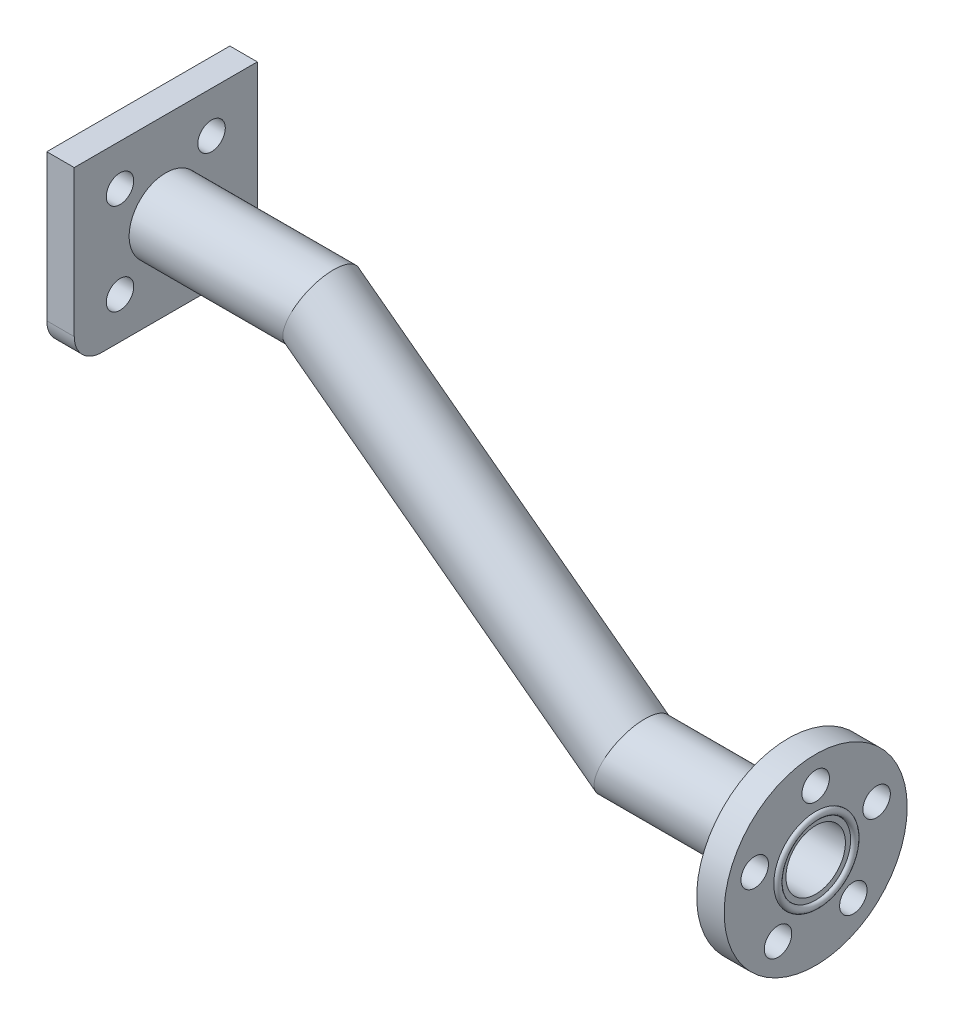
ISO-10303-21;
HEADER;
FILE_DESCRIPTION(('STEP AP214'),'2;1');
FILE_NAME('part.step','',(''),(''),'','','');
FILE_SCHEMA(('AUTOMOTIVE_DESIGN { 1 0 10303 214 1 1 1 1 }'));
ENDSEC;
DATA;
#1=APPLICATION_CONTEXT('core data for automotive mechanical design processes');
#2=APPLICATION_PROTOCOL_DEFINITION('international standard','automotive_design',2000,#1);
#3=PRODUCT_CONTEXT('',#1,'mechanical');
#4=PRODUCT('Part','Part','',(#3));
#5=PRODUCT_RELATED_PRODUCT_CATEGORY('part','',(#4));
#6=PRODUCT_DEFINITION_FORMATION('','',#4);
#7=PRODUCT_DEFINITION_CONTEXT('part definition',#1,'design');
#8=PRODUCT_DEFINITION('design','',#6,#7);
#9=PRODUCT_DEFINITION_SHAPE('','',#8);
#10=(LENGTH_UNIT() NAMED_UNIT(*) SI_UNIT(.MILLI.,.METRE.));
#11=(NAMED_UNIT(*) PLANE_ANGLE_UNIT() SI_UNIT($,.RADIAN.));
#12=(NAMED_UNIT(*) SI_UNIT($,.STERADIAN.) SOLID_ANGLE_UNIT());
#13=UNCERTAINTY_MEASURE_WITH_UNIT(LENGTH_MEASURE(1.E-05),#10,'distance_accuracy_value','');
#14=(GEOMETRIC_REPRESENTATION_CONTEXT(3) GLOBAL_UNCERTAINTY_ASSIGNED_CONTEXT((#13)) GLOBAL_UNIT_ASSIGNED_CONTEXT((#10,
#11,#12)) REPRESENTATION_CONTEXT('',''));
#15=CARTESIAN_POINT('',(0.,0.,0.));
#16=DIRECTION('',(0.,0.,1.));
#17=DIRECTION('',(1.,0.,0.));
#18=AXIS2_PLACEMENT_3D('',#15,#16,#17);
#19=CARTESIAN_POINT('',(71.,-25.5,0.));
#20=DIRECTION('',(1.,0.,0.));
#21=DIRECTION('',(0.,0.,-1.));
#22=AXIS2_PLACEMENT_3D('',#19,#20,#21);
#23=PLANE('',#22);
#24=CARTESIAN_POINT('',(71.,-25.5,0.));
#25=DIRECTION('',(1.,0.,0.));
#26=DIRECTION('',(0.,0.,-1.));
#27=AXIS2_PLACEMENT_3D('',#24,#25,#26);
#28=CIRCLE('',#27,10.);
#29=CARTESIAN_POINT('',(71.,-25.5,-10.));
#30=VERTEX_POINT('',#29);
#31=EDGE_CURVE('E193',#30,#30,#28,.T.);
#32=ORIENTED_EDGE('',*,*,#31,.T.);
#33=EDGE_LOOP('',(#32));
#34=FACE_BOUND('',#33,.T.);
#35=CARTESIAN_POINT('',(71.,-23.3368810393754,-6.65739561406608));
#36=DIRECTION('',(1.,0.,0.));
#37=DIRECTION('',(0.,0.,-1.));
#38=AXIS2_PLACEMENT_3D('',#35,#36,#37);
#39=CIRCLE('',#38,1.5);
#40=CARTESIAN_POINT('',(71.,-23.3368810393754,-8.15739561406608));
#41=VERTEX_POINT('',#40);
#42=EDGE_CURVE('E337',#41,#41,#39,.T.);
#43=ORIENTED_EDGE('',*,*,#42,.F.);
#44=EDGE_LOOP('',(#43));
#45=FACE_BOUND('',#44,.T.);
#46=CARTESIAN_POINT('',(71.,-23.3368810393753,6.65739561406605));
#47=DIRECTION('',(1.,0.,0.));
#48=DIRECTION('',(0.,0.,-1.));
#49=AXIS2_PLACEMENT_3D('',#46,#47,#48);
#50=CIRCLE('',#49,1.5);
#51=CARTESIAN_POINT('',(71.,-23.3368810393753,5.15739561406605));
#52=VERTEX_POINT('',#51);
#53=EDGE_CURVE('E237',#52,#52,#50,.T.);
#54=ORIENTED_EDGE('',*,*,#53,.F.);
#55=EDGE_LOOP('',(#54));
#56=FACE_BOUND('',#55,.T.);
#57=CARTESIAN_POINT('',(71.,-31.1631189606247,-4.11449676604728));
#58=DIRECTION('',(1.,0.,0.));
#59=DIRECTION('',(0.,0.,-1.));
#60=AXIS2_PLACEMENT_3D('',#57,#58,#59);
#61=CIRCLE('',#60,1.5);
#62=CARTESIAN_POINT('',(71.,-31.1631189606247,-5.61449676604728));
#63=VERTEX_POINT('',#62);
#64=EDGE_CURVE('E361',#63,#63,#61,.T.);
#65=ORIENTED_EDGE('',*,*,#64,.F.);
#66=EDGE_LOOP('',(#65));
#67=FACE_BOUND('',#66,.T.);
#68=CARTESIAN_POINT('',(71.,-31.1631189606246,4.11449676604736));
#69=DIRECTION('',(1.,0.,0.));
#70=DIRECTION('',(0.,0.,-1.));
#71=AXIS2_PLACEMENT_3D('',#68,#69,#70);
#72=CIRCLE('',#71,1.5);
#73=CARTESIAN_POINT('',(71.,-31.1631189606246,2.61449676604736));
#74=VERTEX_POINT('',#73);
#75=EDGE_CURVE('E345',#74,#74,#72,.T.);
#76=ORIENTED_EDGE('',*,*,#75,.F.);
#77=EDGE_LOOP('',(#76));
#78=FACE_BOUND('',#77,.T.);
#79=CARTESIAN_POINT('',(71.,-18.5,0.));
#80=DIRECTION('',(1.,0.,0.));
#81=DIRECTION('',(0.,0.,-1.));
#82=AXIS2_PLACEMENT_3D('',#79,#80,#81);
#83=CIRCLE('',#82,1.5);
#84=CARTESIAN_POINT('',(71.,-18.5,-1.5));
#85=VERTEX_POINT('',#84);
#86=EDGE_CURVE('E353',#85,#85,#83,.T.);
#87=ORIENTED_EDGE('',*,*,#86,.F.);
#88=EDGE_LOOP('',(#87));
#89=FACE_BOUND('',#88,.T.);
#90=CARTESIAN_POINT('',(71.,-25.5,0.));
#91=DIRECTION('',(1.,0.,0.));
#92=DIRECTION('',(0.,0.,-1.));
#93=AXIS2_PLACEMENT_3D('',#90,#91,#92);
#94=CIRCLE('',#93,4.58000000000001);
#95=CARTESIAN_POINT('',(71.,-25.5,-4.58000000000001));
#96=VERTEX_POINT('',#95);
#97=EDGE_CURVE('E11',#96,#96,#94,.T.);
#98=ORIENTED_EDGE('',*,*,#97,.F.);
#99=EDGE_LOOP('',(#98));
#100=FACE_BOUND('',#99,.T.);
#101=ADVANCED_FACE('F41',(#34,#45,#56,#67,#78,#89,#100),#23,.T.);
#102=CARTESIAN_POINT('',(-3.,-6.5,10.));
#103=DIRECTION('',(0.,0.,1.));
#104=DIRECTION('',(1.,0.,0.));
#105=AXIS2_PLACEMENT_3D('',#102,#103,#104);
#106=PLANE('',#105);
#107=DIRECTION('',(0.,-1.,0.));
#108=VECTOR('',#107,1.);
#109=CARTESIAN_POINT('',(0.,-6.5,10.));
#110=LINE('',#109,#108);
#111=CARTESIAN_POINT('',(0.,9.5,10.));
#112=VERTEX_POINT('',#111);
#113=CARTESIAN_POINT('',(0.,-6.5,10.));
#114=VERTEX_POINT('',#113);
#115=EDGE_CURVE('E135',#112,#114,#110,.T.);
#116=ORIENTED_EDGE('',*,*,#115,.F.);
#117=DIRECTION('',(1.,0.,0.));
#118=VECTOR('',#117,1.);
#119=CARTESIAN_POINT('',(-3.,9.5,10.));
#120=LINE('',#119,#118);
#121=CARTESIAN_POINT('',(-3.,9.5,10.));
#122=VERTEX_POINT('',#121);
#123=EDGE_CURVE('E59',#122,#112,#120,.T.);
#124=ORIENTED_EDGE('',*,*,#123,.F.);
#125=DIRECTION('',(0.,-1.,0.));
#126=VECTOR('',#125,1.);
#127=CARTESIAN_POINT('',(-3.,-6.5,10.));
#128=LINE('',#127,#126);
#129=CARTESIAN_POINT('',(-3.,-6.5,10.));
#130=VERTEX_POINT('',#129);
#131=EDGE_CURVE('E157',#122,#130,#128,.T.);
#132=ORIENTED_EDGE('',*,*,#131,.T.);
#133=DIRECTION('',(1.,0.,0.));
#134=VECTOR('',#133,1.);
#135=CARTESIAN_POINT('',(-3.,-6.5,10.));
#136=LINE('',#135,#134);
#137=EDGE_CURVE('E94',#130,#114,#136,.T.);
#138=ORIENTED_EDGE('',*,*,#137,.T.);
#139=EDGE_LOOP('',(#116,#124,#132,#138));
#140=FACE_BOUND('',#139,.T.);
#141=ADVANCED_FACE('F43',(#140),#106,.T.);
#142=CARTESIAN_POINT('',(-3.,9.5,-10.));
#143=DIRECTION('',(0.,1.,0.));
#144=DIRECTION('',(0.,0.,1.));
#145=AXIS2_PLACEMENT_3D('',#142,#143,#144);
#146=PLANE('',#145);
#147=DIRECTION('',(0.,0.,1.));
#148=VECTOR('',#147,1.);
#149=CARTESIAN_POINT('',(0.,9.5,-10.));
#150=LINE('',#149,#148);
#151=CARTESIAN_POINT('',(0.,9.5,-10.));
#152=VERTEX_POINT('',#151);
#153=EDGE_CURVE('E153',#152,#112,#150,.T.);
#154=ORIENTED_EDGE('',*,*,#153,.F.);
#155=DIRECTION('',(1.,0.,0.));
#156=VECTOR('',#155,1.);
#157=CARTESIAN_POINT('',(-3.,9.5,-10.));
#158=LINE('',#157,#156);
#159=CARTESIAN_POINT('',(-3.,9.5,-10.));
#160=VERTEX_POINT('',#159);
#161=EDGE_CURVE('E82',#160,#152,#158,.T.);
#162=ORIENTED_EDGE('',*,*,#161,.F.);
#163=DIRECTION('',(0.,0.,1.));
#164=VECTOR('',#163,1.);
#165=CARTESIAN_POINT('',(-3.,9.5,-10.));
#166=LINE('',#165,#164);
#167=EDGE_CURVE('E121',#160,#122,#166,.T.);
#168=ORIENTED_EDGE('',*,*,#167,.T.);
#169=ORIENTED_EDGE('',*,*,#123,.T.);
#170=EDGE_LOOP('',(#154,#162,#168,#169));
#171=FACE_BOUND('',#170,.T.);
#172=ADVANCED_FACE('F200',(#171),#146,.T.);
#173=CARTESIAN_POINT('',(-3.,-6.5,-10.));
#174=DIRECTION('',(0.,0.,-1.));
#175=DIRECTION('',(-1.,0.,0.));
#176=AXIS2_PLACEMENT_3D('',#173,#174,#175);
#177=PLANE('',#176);
#178=DIRECTION('',(0.,1.,0.));
#179=VECTOR('',#178,1.);
#180=CARTESIAN_POINT('',(0.,-6.5,-10.));
#181=LINE('',#180,#179);
#182=CARTESIAN_POINT('',(0.,-6.5,-10.));
#183=VERTEX_POINT('',#182);
#184=EDGE_CURVE('E107',#183,#152,#181,.T.);
#185=ORIENTED_EDGE('',*,*,#184,.F.);
#186=DIRECTION('',(1.,0.,0.));
#187=VECTOR('',#186,1.);
#188=CARTESIAN_POINT('',(-3.,-6.5,-10.));
#189=LINE('',#188,#187);
#190=CARTESIAN_POINT('',(-3.,-6.5,-10.));
#191=VERTEX_POINT('',#190);
#192=EDGE_CURVE('E102',#191,#183,#189,.T.);
#193=ORIENTED_EDGE('',*,*,#192,.F.);
#194=DIRECTION('',(0.,1.,0.));
#195=VECTOR('',#194,1.);
#196=CARTESIAN_POINT('',(-3.,-6.5,-10.));
#197=LINE('',#196,#195);
#198=EDGE_CURVE('E105',#191,#160,#197,.T.);
#199=ORIENTED_EDGE('',*,*,#198,.T.);
#200=ORIENTED_EDGE('',*,*,#161,.T.);
#201=EDGE_LOOP('',(#185,#193,#199,#200));
#202=FACE_BOUND('',#201,.T.);
#203=ADVANCED_FACE('F104',(#202),#177,.T.);
#204=CARTESIAN_POINT('',(-3.,-6.5,-7.));
#205=DIRECTION('',(1.,0.,0.));
#206=DIRECTION('',(0.,0.,-1.));
#207=AXIS2_PLACEMENT_3D('',#204,#205,#206);
#208=CYLINDRICAL_SURFACE('',#207,3.);
#209=CARTESIAN_POINT('',(0.,-6.5,-7.));
#210=DIRECTION('',(1.,0.,0.));
#211=DIRECTION('',(0.,0.,-1.));
#212=AXIS2_PLACEMENT_3D('',#209,#210,#211);
#213=CIRCLE('',#212,3.);
#214=CARTESIAN_POINT('',(0.,-9.5,-7.));
#215=VERTEX_POINT('',#214);
#216=EDGE_CURVE('E148',#215,#183,#213,.T.);
#217=ORIENTED_EDGE('',*,*,#216,.F.);
#218=DIRECTION('',(1.,0.,0.));
#219=VECTOR('',#218,1.);
#220=CARTESIAN_POINT('',(-3.,-9.5,-7.));
#221=LINE('',#220,#219);
#222=CARTESIAN_POINT('',(-3.,-9.5,-7.));
#223=VERTEX_POINT('',#222);
#224=EDGE_CURVE('E113',#223,#215,#221,.T.);
#225=ORIENTED_EDGE('',*,*,#224,.F.);
#226=CARTESIAN_POINT('',(-3.,-6.5,-7.));
#227=DIRECTION('',(1.,0.,0.));
#228=DIRECTION('',(0.,0.,-1.));
#229=AXIS2_PLACEMENT_3D('',#226,#227,#228);
#230=CIRCLE('',#229,3.);
#231=EDGE_CURVE('E119',#223,#191,#230,.T.);
#232=ORIENTED_EDGE('',*,*,#231,.T.);
#233=ORIENTED_EDGE('',*,*,#192,.T.);
#234=EDGE_LOOP('',(#217,#225,#232,#233));
#235=FACE_BOUND('',#234,.T.);
#236=ADVANCED_FACE('F124',(#235),#208,.T.);
#237=CARTESIAN_POINT('',(-3.,-9.5,-7.));
#238=DIRECTION('',(0.,-1.,0.));
#239=DIRECTION('',(0.,0.,-1.));
#240=AXIS2_PLACEMENT_3D('',#237,#238,#239);
#241=PLANE('',#240);
#242=DIRECTION('',(0.,0.,-1.));
#243=VECTOR('',#242,1.);
#244=CARTESIAN_POINT('',(0.,-9.5,-7.));
#245=LINE('',#244,#243);
#246=CARTESIAN_POINT('',(0.,-9.5,7.));
#247=VERTEX_POINT('',#246);
#248=EDGE_CURVE('E144',#247,#215,#245,.T.);
#249=ORIENTED_EDGE('',*,*,#248,.F.);
#250=DIRECTION('',(1.,0.,0.));
#251=VECTOR('',#250,1.);
#252=CARTESIAN_POINT('',(-3.,-9.5,7.));
#253=LINE('',#252,#251);
#254=CARTESIAN_POINT('',(-3.,-9.5,7.));
#255=VERTEX_POINT('',#254);
#256=EDGE_CURVE('E165',#255,#247,#253,.T.);
#257=ORIENTED_EDGE('',*,*,#256,.F.);
#258=DIRECTION('',(0.,0.,-1.));
#259=VECTOR('',#258,1.);
#260=CARTESIAN_POINT('',(-3.,-9.5,-7.));
#261=LINE('',#260,#259);
#262=EDGE_CURVE('E126',#255,#223,#261,.T.);
#263=ORIENTED_EDGE('',*,*,#262,.T.);
#264=ORIENTED_EDGE('',*,*,#224,.T.);
#265=EDGE_LOOP('',(#249,#257,#263,#264));
#266=FACE_BOUND('',#265,.T.);
#267=ADVANCED_FACE('F532',(#266),#241,.T.);
#268=CARTESIAN_POINT('',(-3.,-6.5,7.));
#269=DIRECTION('',(1.,0.,0.));
#270=DIRECTION('',(0.,0.,-1.));
#271=AXIS2_PLACEMENT_3D('',#268,#269,#270);
#272=CYLINDRICAL_SURFACE('',#271,3.);
#273=CARTESIAN_POINT('',(0.,-6.5,7.));
#274=DIRECTION('',(1.,0.,0.));
#275=DIRECTION('',(0.,0.,1.));
#276=AXIS2_PLACEMENT_3D('',#273,#274,#275);
#277=CIRCLE('',#276,3.);
#278=EDGE_CURVE('E139',#114,#247,#277,.T.);
#279=ORIENTED_EDGE('',*,*,#278,.F.);
#280=ORIENTED_EDGE('',*,*,#137,.F.);
#281=CARTESIAN_POINT('',(-3.,-6.5,7.));
#282=DIRECTION('',(1.,0.,0.));
#283=DIRECTION('',(0.,0.,1.));
#284=AXIS2_PLACEMENT_3D('',#281,#282,#283);
#285=CIRCLE('',#284,3.);
#286=EDGE_CURVE('E129',#130,#255,#285,.T.);
#287=ORIENTED_EDGE('',*,*,#286,.T.);
#288=ORIENTED_EDGE('',*,*,#256,.T.);
#289=EDGE_LOOP('',(#279,#280,#287,#288));
#290=FACE_BOUND('',#289,.T.);
#291=ADVANCED_FACE('F196',(#290),#272,.T.);
#292=CARTESIAN_POINT('',(-3.,-6.5,-7.));
#293=DIRECTION('',(1.,0.,0.));
#294=DIRECTION('',(0.,0.,-1.));
#295=AXIS2_PLACEMENT_3D('',#292,#293,#294);
#296=PLANE('',#295);
#297=CARTESIAN_POINT('',(-3.,-5.,-5.));
#298=DIRECTION('',(-1.,0.,0.));
#299=DIRECTION('',(0.,0.,-1.));
#300=AXIS2_PLACEMENT_3D('',#297,#298,#299);
#301=CIRCLE('',#300,1.5);
#302=CARTESIAN_POINT('',(-3.,-5.,-6.5));
#303=VERTEX_POINT('',#302);
#304=EDGE_CURVE('E332',#303,#303,#301,.T.);
#305=ORIENTED_EDGE('',*,*,#304,.F.);
#306=EDGE_LOOP('',(#305));
#307=FACE_BOUND('',#306,.T.);
#308=CARTESIAN_POINT('',(-3.,-5.,5.));
#309=DIRECTION('',(-1.,0.,0.));
#310=DIRECTION('',(0.,0.,1.));
#311=AXIS2_PLACEMENT_3D('',#308,#309,#310);
#312=CIRCLE('',#311,1.5);
#313=CARTESIAN_POINT('',(-3.,-5.,6.5));
#314=VERTEX_POINT('',#313);
#315=EDGE_CURVE('E326',#314,#314,#312,.T.);
#316=ORIENTED_EDGE('',*,*,#315,.F.);
#317=EDGE_LOOP('',(#316));
#318=FACE_BOUND('',#317,.T.);
#319=CARTESIAN_POINT('',(-3.,5.,5.));
#320=DIRECTION('',(-1.,0.,0.));
#321=DIRECTION('',(0.,0.,-1.));
#322=AXIS2_PLACEMENT_3D('',#319,#320,#321);
#323=CIRCLE('',#322,1.5);
#324=CARTESIAN_POINT('',(-3.,5.,3.5));
#325=VERTEX_POINT('',#324);
#326=EDGE_CURVE('E320',#325,#325,#323,.T.);
#327=ORIENTED_EDGE('',*,*,#326,.F.);
#328=EDGE_LOOP('',(#327));
#329=FACE_BOUND('',#328,.T.);
#330=CARTESIAN_POINT('',(-3.,5.,-5.));
#331=DIRECTION('',(-1.,0.,0.));
#332=DIRECTION('',(0.,0.,1.));
#333=AXIS2_PLACEMENT_3D('',#330,#331,#332);
#334=CIRCLE('',#333,1.5);
#335=CARTESIAN_POINT('',(-3.,5.,-3.5));
#336=VERTEX_POINT('',#335);
#337=EDGE_CURVE('E305',#336,#336,#334,.T.);
#338=ORIENTED_EDGE('',*,*,#337,.F.);
#339=EDGE_LOOP('',(#338));
#340=FACE_BOUND('',#339,.T.);
#341=CARTESIAN_POINT('',(-3.,0.,0.));
#342=DIRECTION('',(-1.,0.,0.));
#343=DIRECTION('',(0.,0.,1.));
#344=AXIS2_PLACEMENT_3D('',#341,#342,#343);
#345=CIRCLE('',#344,3.25);
#346=CARTESIAN_POINT('',(-3.,0.,3.25));
#347=VERTEX_POINT('',#346);
#348=EDGE_CURVE('E304',#347,#347,#345,.T.);
#349=ORIENTED_EDGE('',*,*,#348,.F.);
#350=EDGE_LOOP('',(#349));
#351=FACE_BOUND('',#350,.T.);
#352=ORIENTED_EDGE('',*,*,#131,.F.);
#353=ORIENTED_EDGE('',*,*,#167,.F.);
#354=ORIENTED_EDGE('',*,*,#198,.F.);
#355=ORIENTED_EDGE('',*,*,#231,.F.);
#356=ORIENTED_EDGE('',*,*,#262,.F.);
#357=ORIENTED_EDGE('',*,*,#286,.F.);
#358=EDGE_LOOP('',(#352,#353,#354,#355,#356,#357));
#359=FACE_BOUND('',#358,.T.);
#360=ADVANCED_FACE('F117',(#307,#318,#329,#340,#351,#359),#296,.F.);
#361=CARTESIAN_POINT('',(0.,-6.5,-7.));
#362=DIRECTION('',(1.,0.,0.));
#363=DIRECTION('',(0.,0.,-1.));
#364=AXIS2_PLACEMENT_3D('',#361,#362,#363);
#365=PLANE('',#364);
#366=CARTESIAN_POINT('',(0.,-5.,-5.));
#367=DIRECTION('',(-1.,0.,0.));
#368=DIRECTION('',(0.,0.,-1.));
#369=AXIS2_PLACEMENT_3D('',#366,#367,#368);
#370=CIRCLE('',#369,1.5);
#371=CARTESIAN_POINT('',(0.,-5.,-6.5));
#372=VERTEX_POINT('',#371);
#373=EDGE_CURVE('E290',#372,#372,#370,.T.);
#374=ORIENTED_EDGE('',*,*,#373,.T.);
#375=EDGE_LOOP('',(#374));
#376=FACE_BOUND('',#375,.T.);
#377=CARTESIAN_POINT('',(0.,-5.,5.));
#378=DIRECTION('',(-1.,0.,0.));
#379=DIRECTION('',(0.,0.,1.));
#380=AXIS2_PLACEMENT_3D('',#377,#378,#379);
#381=CIRCLE('',#380,1.5);
#382=CARTESIAN_POINT('',(0.,-5.,6.5));
#383=VERTEX_POINT('',#382);
#384=EDGE_CURVE('E294',#383,#383,#381,.T.);
#385=ORIENTED_EDGE('',*,*,#384,.T.);
#386=EDGE_LOOP('',(#385));
#387=FACE_BOUND('',#386,.T.);
#388=CARTESIAN_POINT('',(0.,5.,5.));
#389=DIRECTION('',(-1.,0.,0.));
#390=DIRECTION('',(0.,0.,-1.));
#391=AXIS2_PLACEMENT_3D('',#388,#389,#390);
#392=CIRCLE('',#391,1.5);
#393=CARTESIAN_POINT('',(0.,5.,3.5));
#394=VERTEX_POINT('',#393);
#395=EDGE_CURVE('E298',#394,#394,#392,.T.);
#396=ORIENTED_EDGE('',*,*,#395,.T.);
#397=EDGE_LOOP('',(#396));
#398=FACE_BOUND('',#397,.T.);
#399=CARTESIAN_POINT('',(0.,5.,-5.));
#400=DIRECTION('',(-1.,0.,0.));
#401=DIRECTION('',(0.,0.,1.));
#402=AXIS2_PLACEMENT_3D('',#399,#400,#401);
#403=CIRCLE('',#402,1.5);
#404=CARTESIAN_POINT('',(0.,5.,-3.5));
#405=VERTEX_POINT('',#404);
#406=EDGE_CURVE('E302',#405,#405,#403,.T.);
#407=ORIENTED_EDGE('',*,*,#406,.T.);
#408=EDGE_LOOP('',(#407));
#409=FACE_BOUND('',#408,.T.);
#410=CARTESIAN_POINT('',(0.,0.,0.));
#411=DIRECTION('',(1.,0.,0.));
#412=DIRECTION('',(0.,0.,-1.));
#413=AXIS2_PLACEMENT_3D('',#410,#411,#412);
#414=CIRCLE('',#413,4.00071238240547);
#415=CARTESIAN_POINT('',(0.,0.,-4.00071238240547));
#416=VERTEX_POINT('',#415);
#417=EDGE_CURVE('E160',#416,#416,#414,.T.);
#418=ORIENTED_EDGE('',*,*,#417,.F.);
#419=EDGE_LOOP('',(#418));
#420=FACE_BOUND('',#419,.T.);
#421=ORIENTED_EDGE('',*,*,#115,.T.);
#422=ORIENTED_EDGE('',*,*,#278,.T.);
#423=ORIENTED_EDGE('',*,*,#248,.T.);
#424=ORIENTED_EDGE('',*,*,#216,.T.);
#425=ORIENTED_EDGE('',*,*,#184,.T.);
#426=ORIENTED_EDGE('',*,*,#153,.T.);
#427=EDGE_LOOP('',(#421,#422,#423,#424,#425,#426));
#428=FACE_BOUND('',#427,.T.);
#429=ADVANCED_FACE('F199',(#376,#387,#398,#409,#420,#428),#365,.T.);
#430=CARTESIAN_POINT('',(47.9661442529027,-25.5,0.));
#431=DIRECTION('',(1.,0.,0.));
#432=DIRECTION('',(0.,1.,0.));
#433=AXIS2_PLACEMENT_3D('',#430,#431,#432);
#434=CYLINDRICAL_SURFACE('',#433,4.00071238240547);
#435=CARTESIAN_POINT('',(51.,-25.5,0.));
#436=DIRECTION('',(0.948683298050514,-0.316227766016838,0.));
#437=DIRECTION('',(-0.316227766016838,-0.948683298050514,0.));
#438=AXIS2_PLACEMENT_3D('',#435,#436,#437);
#439=ELLIPSE('',#438,4.21712113054662,4.00071238240547);
#440=CARTESIAN_POINT('',(49.6664292058648,-29.5007123824055,0.));
#441=VERTEX_POINT('',#440);
#442=EDGE_CURVE('E185',#441,#441,#439,.F.);
#443=ORIENTED_EDGE('',*,*,#442,.F.);
#444=EDGE_LOOP('',(#443));
#445=FACE_BOUND('',#444,.T.);
#446=CARTESIAN_POINT('',(68.,-25.5,0.));
#447=DIRECTION('',(1.,0.,0.));
#448=DIRECTION('',(0.,0.,-1.));
#449=AXIS2_PLACEMENT_3D('',#446,#447,#448);
#450=CIRCLE('',#449,4.00071238240547);
#451=CARTESIAN_POINT('',(68.,-25.5,-4.00071238240547));
#452=VERTEX_POINT('',#451);
#453=EDGE_CURVE('E189',#452,#452,#450,.T.);
#454=ORIENTED_EDGE('',*,*,#453,.F.);
#455=EDGE_LOOP('',(#454));
#456=FACE_BOUND('',#455,.T.);
#457=ADVANCED_FACE('F257',(#445,#456),#434,.T.);
#458=CARTESIAN_POINT('',(14.5729154023221,1.82031344825841,0.));
#459=DIRECTION('',(0.8,-0.6,0.));
#460=DIRECTION('',(0.6,0.8,0.));
#461=AXIS2_PLACEMENT_3D('',#458,#459,#460);
#462=CYLINDRICAL_SURFACE('',#461,4.00071238240547);
#463=CARTESIAN_POINT('',(17.,0.,0.));
#464=DIRECTION('',(0.948683298050514,-0.316227766016838,0.));
#465=DIRECTION('',(0.316227766016838,0.948683298050514,0.));
#466=AXIS2_PLACEMENT_3D('',#463,#464,#465);
#467=ELLIPSE('',#466,4.21712113054661,4.00071238240547);
#468=CARTESIAN_POINT('',(18.3335707941352,4.00071238240547,0.));
#469=VERTEX_POINT('',#468);
#470=EDGE_CURVE('E140',#469,#469,#467,.F.);
#471=ORIENTED_EDGE('',*,*,#470,.F.);
#472=EDGE_LOOP('',(#471));
#473=FACE_BOUND('',#472,.T.);
#474=ORIENTED_EDGE('',*,*,#442,.T.);
#475=EDGE_LOOP('',(#474));
#476=FACE_BOUND('',#475,.T.);
#477=ADVANCED_FACE('F274',(#473,#476),#462,.T.);
#478=CARTESIAN_POINT('',(0.,0.,0.));
#479=DIRECTION('',(1.,0.,0.));
#480=DIRECTION('',(0.,0.,-1.));
#481=AXIS2_PLACEMENT_3D('',#478,#479,#480);
#482=CYLINDRICAL_SURFACE('',#481,4.00071238240547);
#483=ORIENTED_EDGE('',*,*,#417,.T.);
#484=EDGE_LOOP('',(#483));
#485=FACE_BOUND('',#484,.T.);
#486=ORIENTED_EDGE('',*,*,#470,.T.);
#487=EDGE_LOOP('',(#486));
#488=FACE_BOUND('',#487,.T.);
#489=ADVANCED_FACE('F255',(#485,#488),#482,.T.);
#490=CARTESIAN_POINT('',(71.,-25.5,0.));
#491=DIRECTION('',(-1.,0.,0.));
#492=DIRECTION('',(0.,0.,1.));
#493=AXIS2_PLACEMENT_3D('',#490,#491,#492);
#494=CYLINDRICAL_SURFACE('',#493,10.);
#495=ORIENTED_EDGE('',*,*,#31,.F.);
#496=EDGE_LOOP('',(#495));
#497=FACE_BOUND('',#496,.T.);
#498=CARTESIAN_POINT('',(68.,-25.5,0.));
#499=DIRECTION('',(1.,0.,0.));
#500=DIRECTION('',(0.,0.,-1.));
#501=AXIS2_PLACEMENT_3D('',#498,#499,#500);
#502=CIRCLE('',#501,10.);
#503=CARTESIAN_POINT('',(68.,-25.5,-10.));
#504=VERTEX_POINT('',#503);
#505=EDGE_CURVE('E180',#504,#504,#502,.T.);
#506=ORIENTED_EDGE('',*,*,#505,.T.);
#507=EDGE_LOOP('',(#506));
#508=FACE_BOUND('',#507,.T.);
#509=ADVANCED_FACE('F251',(#497,#508),#494,.T.);
#510=CARTESIAN_POINT('',(68.,-25.5,0.));
#511=DIRECTION('',(1.,0.,0.));
#512=DIRECTION('',(0.,0.,-1.));
#513=AXIS2_PLACEMENT_3D('',#510,#511,#512);
#514=PLANE('',#513);
#515=CARTESIAN_POINT('',(68.,-18.5,0.));
#516=DIRECTION('',(1.,0.,0.));
#517=DIRECTION('',(0.,0.,-1.));
#518=AXIS2_PLACEMENT_3D('',#515,#516,#517);
#519=CIRCLE('',#518,1.5);
#520=CARTESIAN_POINT('',(68.,-18.5,-1.5));
#521=VERTEX_POINT('',#520);
#522=EDGE_CURVE('E341',#521,#521,#519,.T.);
#523=ORIENTED_EDGE('',*,*,#522,.T.);
#524=EDGE_LOOP('',(#523));
#525=FACE_BOUND('',#524,.T.);
#526=CARTESIAN_POINT('',(68.,-31.1631189606246,4.11449676604736));
#527=DIRECTION('',(1.,0.,0.));
#528=DIRECTION('',(0.,0.,-1.));
#529=AXIS2_PLACEMENT_3D('',#526,#527,#528);
#530=CIRCLE('',#529,1.5);
#531=CARTESIAN_POINT('',(68.,-31.1631189606246,2.61449676604736));
#532=VERTEX_POINT('',#531);
#533=EDGE_CURVE('E349',#532,#532,#530,.T.);
#534=ORIENTED_EDGE('',*,*,#533,.T.);
#535=EDGE_LOOP('',(#534));
#536=FACE_BOUND('',#535,.T.);
#537=CARTESIAN_POINT('',(68.,-31.1631189606247,-4.11449676604728));
#538=DIRECTION('',(1.,0.,0.));
#539=DIRECTION('',(0.,0.,-1.));
#540=AXIS2_PLACEMENT_3D('',#537,#538,#539);
#541=CIRCLE('',#540,1.5);
#542=CARTESIAN_POINT('',(68.,-31.1631189606247,-5.61449676604728));
#543=VERTEX_POINT('',#542);
#544=EDGE_CURVE('E246',#543,#543,#541,.T.);
#545=ORIENTED_EDGE('',*,*,#544,.T.);
#546=EDGE_LOOP('',(#545));
#547=FACE_BOUND('',#546,.T.);
#548=CARTESIAN_POINT('',(68.,-23.3368810393753,6.65739561406605));
#549=DIRECTION('',(1.,0.,0.));
#550=DIRECTION('',(0.,0.,-1.));
#551=AXIS2_PLACEMENT_3D('',#548,#549,#550);
#552=CIRCLE('',#551,1.5);
#553=CARTESIAN_POINT('',(68.,-23.3368810393753,5.15739561406605));
#554=VERTEX_POINT('',#553);
#555=EDGE_CURVE('E243',#554,#554,#552,.T.);
#556=ORIENTED_EDGE('',*,*,#555,.T.);
#557=EDGE_LOOP('',(#556));
#558=FACE_BOUND('',#557,.T.);
#559=CARTESIAN_POINT('',(68.,-23.3368810393754,-6.65739561406608));
#560=DIRECTION('',(1.,0.,0.));
#561=DIRECTION('',(0.,0.,-1.));
#562=AXIS2_PLACEMENT_3D('',#559,#560,#561);
#563=CIRCLE('',#562,1.5);
#564=CARTESIAN_POINT('',(68.,-23.3368810393754,-8.15739561406608));
#565=VERTEX_POINT('',#564);
#566=EDGE_CURVE('E310',#565,#565,#563,.T.);
#567=ORIENTED_EDGE('',*,*,#566,.T.);
#568=EDGE_LOOP('',(#567));
#569=FACE_BOUND('',#568,.T.);
#570=ORIENTED_EDGE('',*,*,#453,.T.);
#571=EDGE_LOOP('',(#570));
#572=FACE_BOUND('',#571,.T.);
#573=ORIENTED_EDGE('',*,*,#505,.F.);
#574=EDGE_LOOP('',(#573));
#575=FACE_BOUND('',#574,.T.);
#576=ADVANCED_FACE('F254',(#525,#536,#547,#558,#569,#572,#575),#514,.F.);
#577=CARTESIAN_POINT('',(68.,-23.3368810393754,-6.65739561406608));
#578=DIRECTION('',(1.,0.,0.));
#579=DIRECTION('',(0.,0.,-1.));
#580=AXIS2_PLACEMENT_3D('',#577,#578,#579);
#581=CYLINDRICAL_SURFACE('',#580,1.5);
#582=ORIENTED_EDGE('',*,*,#566,.F.);
#583=EDGE_LOOP('',(#582));
#584=FACE_BOUND('',#583,.T.);
#585=ORIENTED_EDGE('',*,*,#42,.T.);
#586=EDGE_LOOP('',(#585));
#587=FACE_BOUND('',#586,.T.);
#588=ADVANCED_FACE('F261',(#584,#587),#581,.F.);
#589=CARTESIAN_POINT('',(68.,-23.3368810393753,6.65739561406605));
#590=DIRECTION('',(1.,0.,0.));
#591=DIRECTION('',(0.,0.,-1.));
#592=AXIS2_PLACEMENT_3D('',#589,#590,#591);
#593=CYLINDRICAL_SURFACE('',#592,1.5);
#594=ORIENTED_EDGE('',*,*,#555,.F.);
#595=EDGE_LOOP('',(#594));
#596=FACE_BOUND('',#595,.T.);
#597=ORIENTED_EDGE('',*,*,#53,.T.);
#598=EDGE_LOOP('',(#597));
#599=FACE_BOUND('',#598,.T.);
#600=ADVANCED_FACE('F266',(#596,#599),#593,.F.);
#601=CARTESIAN_POINT('',(68.,-31.1631189606247,-4.11449676604728));
#602=DIRECTION('',(1.,0.,0.));
#603=DIRECTION('',(0.,0.,-1.));
#604=AXIS2_PLACEMENT_3D('',#601,#602,#603);
#605=CYLINDRICAL_SURFACE('',#604,1.5);
#606=ORIENTED_EDGE('',*,*,#544,.F.);
#607=EDGE_LOOP('',(#606));
#608=FACE_BOUND('',#607,.T.);
#609=ORIENTED_EDGE('',*,*,#64,.T.);
#610=EDGE_LOOP('',(#609));
#611=FACE_BOUND('',#610,.T.);
#612=ADVANCED_FACE('F372',(#608,#611),#605,.F.);
#613=CARTESIAN_POINT('',(68.,-31.1631189606246,4.11449676604736));
#614=DIRECTION('',(1.,0.,0.));
#615=DIRECTION('',(0.,0.,-1.));
#616=AXIS2_PLACEMENT_3D('',#613,#614,#615);
#617=CYLINDRICAL_SURFACE('',#616,1.5);
#618=ORIENTED_EDGE('',*,*,#533,.F.);
#619=EDGE_LOOP('',(#618));
#620=FACE_BOUND('',#619,.T.);
#621=ORIENTED_EDGE('',*,*,#75,.T.);
#622=EDGE_LOOP('',(#621));
#623=FACE_BOUND('',#622,.T.);
#624=ADVANCED_FACE('F374',(#620,#623),#617,.F.);
#625=CARTESIAN_POINT('',(68.,-18.5,0.));
#626=DIRECTION('',(1.,0.,0.));
#627=DIRECTION('',(0.,0.,-1.));
#628=AXIS2_PLACEMENT_3D('',#625,#626,#627);
#629=CYLINDRICAL_SURFACE('',#628,1.5);
#630=ORIENTED_EDGE('',*,*,#522,.F.);
#631=EDGE_LOOP('',(#630));
#632=FACE_BOUND('',#631,.T.);
#633=ORIENTED_EDGE('',*,*,#86,.T.);
#634=EDGE_LOOP('',(#633));
#635=FACE_BOUND('',#634,.T.);
#636=ADVANCED_FACE('F380',(#632,#635),#629,.F.);
#637=CARTESIAN_POINT('',(71.,-25.5,0.));
#638=DIRECTION('',(-1.,0.,0.));
#639=DIRECTION('',(0.,-1.,0.));
#640=AXIS2_PLACEMENT_3D('',#637,#638,#639);
#641=TOROIDAL_SURFACE('',#640,4.2,0.380000000000011);
#642=ORIENTED_EDGE('',*,*,#97,.T.);
#643=EDGE_LOOP('',(#642));
#644=FACE_BOUND('',#643,.T.);
#645=CARTESIAN_POINT('',(71.,-25.5,0.));
#646=DIRECTION('',(-1.,0.,0.));
#647=DIRECTION('',(0.,0.,1.));
#648=AXIS2_PLACEMENT_3D('',#645,#646,#647);
#649=CIRCLE('',#648,3.81999999999999);
#650=CARTESIAN_POINT('',(71.,-25.5,3.81999999999999));
#651=VERTEX_POINT('',#650);
#652=EDGE_CURVE('E51',#651,#651,#649,.T.);
#653=ORIENTED_EDGE('',*,*,#652,.T.);
#654=EDGE_LOOP('',(#653));
#655=FACE_BOUND('',#654,.T.);
#656=ADVANCED_FACE('F230',(#644,#655),#641,.T.);
#657=CARTESIAN_POINT('',(68.,-25.5,0.));
#658=DIRECTION('',(1.,0.,0.));
#659=DIRECTION('',(0.,0.,-1.));
#660=AXIS2_PLACEMENT_3D('',#657,#658,#659);
#661=CYLINDRICAL_SURFACE('',#660,3.25);
#662=CARTESIAN_POINT('',(71.,-25.5,0.));
#663=DIRECTION('',(1.,0.,0.));
#664=DIRECTION('',(0.,0.,-1.));
#665=AXIS2_PLACEMENT_3D('',#662,#663,#664);
#666=CIRCLE('',#665,3.25);
#667=CARTESIAN_POINT('',(71.,-25.5,-3.25));
#668=VERTEX_POINT('',#667);
#669=EDGE_CURVE('E235',#668,#668,#666,.T.);
#670=ORIENTED_EDGE('',*,*,#669,.T.);
#671=EDGE_LOOP('',(#670));
#672=FACE_BOUND('',#671,.T.);
#673=CARTESIAN_POINT('',(51.,-25.5,0.));
#674=DIRECTION('',(0.948683298050514,-0.316227766016838,0.));
#675=DIRECTION('',(-0.316227766016838,-0.948683298050514,0.));
#676=AXIS2_PLACEMENT_3D('',#673,#674,#675);
#677=ELLIPSE('',#676,3.42580079851574,3.25);
#678=CARTESIAN_POINT('',(49.9166666666667,-28.75,0.));
#679=VERTEX_POINT('',#678);
#680=EDGE_CURVE('E315',#679,#679,#677,.T.);
#681=ORIENTED_EDGE('',*,*,#680,.F.);
#682=EDGE_LOOP('',(#681));
#683=FACE_BOUND('',#682,.T.);
#684=ADVANCED_FACE('F221',(#672,#683),#661,.F.);
#685=ORIENTED_EDGE('',*,*,#669,.F.);
#686=EDGE_LOOP('',(#685));
#687=FACE_BOUND('',#686,.T.);
#688=ORIENTED_EDGE('',*,*,#652,.F.);
#689=EDGE_LOOP('',(#688));
#690=FACE_BOUND('',#689,.T.);
#691=ADVANCED_FACE('F212',(#687,#690),#23,.T.);
#692=CARTESIAN_POINT('',(0.,5.,-5.));
#693=DIRECTION('',(-1.,0.,0.));
#694=DIRECTION('',(0.,0.,1.));
#695=AXIS2_PLACEMENT_3D('',#692,#693,#694);
#696=CYLINDRICAL_SURFACE('',#695,1.5);
#697=ORIENTED_EDGE('',*,*,#406,.F.);
#698=EDGE_LOOP('',(#697));
#699=FACE_BOUND('',#698,.T.);
#700=ORIENTED_EDGE('',*,*,#337,.T.);
#701=EDGE_LOOP('',(#700));
#702=FACE_BOUND('',#701,.T.);
#703=ADVANCED_FACE('F220',(#699,#702),#696,.F.);
#704=CARTESIAN_POINT('',(0.,5.,5.));
#705=DIRECTION('',(-1.,0.,0.));
#706=DIRECTION('',(0.,0.,1.));
#707=AXIS2_PLACEMENT_3D('',#704,#705,#706);
#708=CYLINDRICAL_SURFACE('',#707,1.5);
#709=ORIENTED_EDGE('',*,*,#395,.F.);
#710=EDGE_LOOP('',(#709));
#711=FACE_BOUND('',#710,.T.);
#712=ORIENTED_EDGE('',*,*,#326,.T.);
#713=EDGE_LOOP('',(#712));
#714=FACE_BOUND('',#713,.T.);
#715=ADVANCED_FACE('F227',(#711,#714),#708,.F.);
#716=CARTESIAN_POINT('',(0.,-5.,5.));
#717=DIRECTION('',(-1.,0.,0.));
#718=DIRECTION('',(0.,0.,1.));
#719=AXIS2_PLACEMENT_3D('',#716,#717,#718);
#720=CYLINDRICAL_SURFACE('',#719,1.5);
#721=ORIENTED_EDGE('',*,*,#384,.F.);
#722=EDGE_LOOP('',(#721));
#723=FACE_BOUND('',#722,.T.);
#724=ORIENTED_EDGE('',*,*,#315,.T.);
#725=EDGE_LOOP('',(#724));
#726=FACE_BOUND('',#725,.T.);
#727=ADVANCED_FACE('F400',(#723,#726),#720,.F.);
#728=CARTESIAN_POINT('',(0.,-5.,-5.));
#729=DIRECTION('',(-1.,0.,0.));
#730=DIRECTION('',(0.,0.,1.));
#731=AXIS2_PLACEMENT_3D('',#728,#729,#730);
#732=CYLINDRICAL_SURFACE('',#731,1.5);
#733=ORIENTED_EDGE('',*,*,#373,.F.);
#734=EDGE_LOOP('',(#733));
#735=FACE_BOUND('',#734,.T.);
#736=ORIENTED_EDGE('',*,*,#304,.T.);
#737=EDGE_LOOP('',(#736));
#738=FACE_BOUND('',#737,.T.);
#739=ADVANCED_FACE('F396',(#735,#738),#732,.F.);
#740=CARTESIAN_POINT('',(0.,0.,0.));
#741=DIRECTION('',(-1.,0.,0.));
#742=DIRECTION('',(0.,0.,1.));
#743=AXIS2_PLACEMENT_3D('',#740,#741,#742);
#744=CYLINDRICAL_SURFACE('',#743,3.25);
#745=ORIENTED_EDGE('',*,*,#348,.T.);
#746=EDGE_LOOP('',(#745));
#747=FACE_BOUND('',#746,.T.);
#748=CARTESIAN_POINT('',(17.,0.,0.));
#749=DIRECTION('',(0.948683298050514,-0.316227766016838,0.));
#750=DIRECTION('',(0.316227766016838,0.948683298050514,0.));
#751=AXIS2_PLACEMENT_3D('',#748,#749,#750);
#752=ELLIPSE('',#751,3.42580079851574,3.25);
#753=CARTESIAN_POINT('',(18.0833333333333,3.25,0.));
#754=VERTEX_POINT('',#753);
#755=EDGE_CURVE('E335',#754,#754,#752,.T.);
#756=ORIENTED_EDGE('',*,*,#755,.T.);
#757=EDGE_LOOP('',(#756));
#758=FACE_BOUND('',#757,.T.);
#759=ADVANCED_FACE('F392',(#747,#758),#744,.F.);
#760=CARTESIAN_POINT('',(15.0133333333333,1.49,0.));
#761=DIRECTION('',(0.8,-0.6,0.));
#762=DIRECTION('',(0.6,0.8,0.));
#763=AXIS2_PLACEMENT_3D('',#760,#761,#762);
#764=CYLINDRICAL_SURFACE('',#763,3.25);
#765=ORIENTED_EDGE('',*,*,#755,.F.);
#766=EDGE_LOOP('',(#765));
#767=FACE_BOUND('',#766,.T.);
#768=ORIENTED_EDGE('',*,*,#680,.T.);
#769=EDGE_LOOP('',(#768));
#770=FACE_BOUND('',#769,.T.);
#771=ADVANCED_FACE('F395',(#767,#770),#764,.F.);
#772=CLOSED_SHELL('',(#101,#141,#172,#203,#236,#267,#291,#360,#429,#457,#477,#489,#509,#576,
#588,#600,#612,#624,#636,#656,#684,#691,#703,#715,#727,#739,#759,#771));
#773=MANIFOLD_SOLID_BREP('B2',#772);
#774=ADVANCED_BREP_SHAPE_REPRESENTATION('',(#18,#773),#14);
#775=SHAPE_DEFINITION_REPRESENTATION(#9,#774);
ENDSEC;
END-ISO-10303-21;
